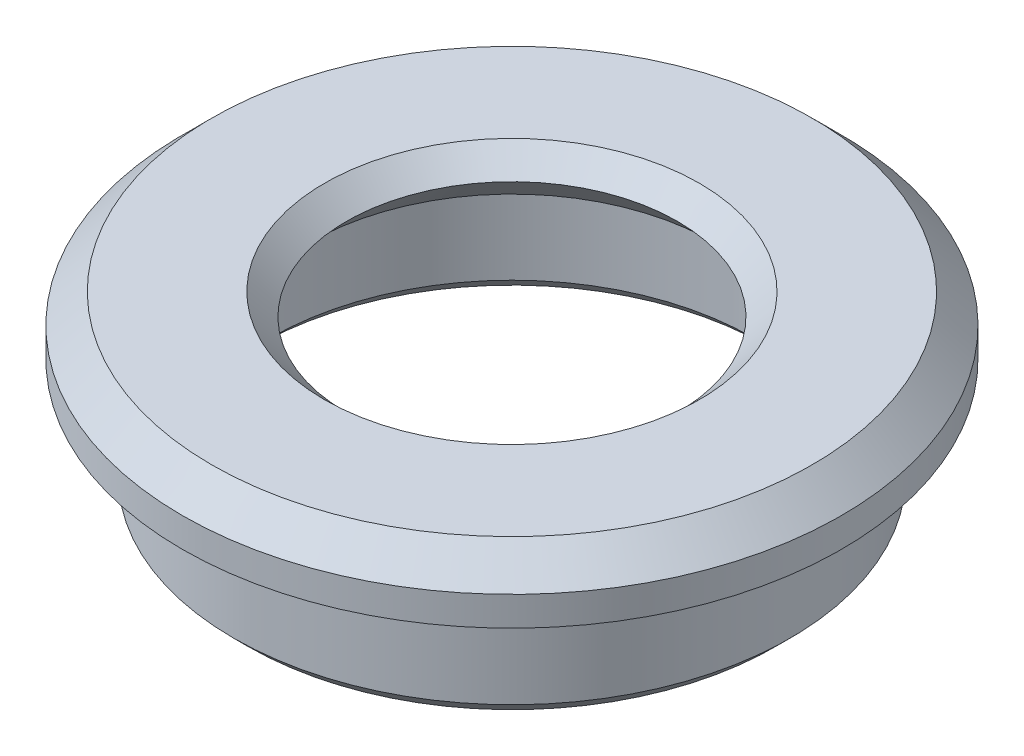
ISO-10303-21;
HEADER;
FILE_DESCRIPTION(('STEP AP214'),'2;1');
FILE_NAME('part.step','',(''),(''),'','','');
FILE_SCHEMA(('AUTOMOTIVE_DESIGN { 1 0 10303 214 1 1 1 1 }'));
ENDSEC;
DATA;
#1=APPLICATION_CONTEXT('core data for automotive mechanical design processes');
#2=APPLICATION_PROTOCOL_DEFINITION('international standard','automotive_design',2000,#1);
#3=PRODUCT_CONTEXT('',#1,'mechanical');
#4=PRODUCT('Part','Part','',(#3));
#5=PRODUCT_RELATED_PRODUCT_CATEGORY('part','',(#4));
#6=PRODUCT_DEFINITION_FORMATION('','',#4);
#7=PRODUCT_DEFINITION_CONTEXT('part definition',#1,'design');
#8=PRODUCT_DEFINITION('design','',#6,#7);
#9=PRODUCT_DEFINITION_SHAPE('','',#8);
#10=(LENGTH_UNIT() NAMED_UNIT(*) SI_UNIT(.MILLI.,.METRE.));
#11=(NAMED_UNIT(*) PLANE_ANGLE_UNIT() SI_UNIT($,.RADIAN.));
#12=(NAMED_UNIT(*) SI_UNIT($,.STERADIAN.) SOLID_ANGLE_UNIT());
#13=UNCERTAINTY_MEASURE_WITH_UNIT(LENGTH_MEASURE(1.E-05),#10,'distance_accuracy_value','');
#14=(GEOMETRIC_REPRESENTATION_CONTEXT(3) GLOBAL_UNCERTAINTY_ASSIGNED_CONTEXT((#13)) GLOBAL_UNIT_ASSIGNED_CONTEXT((#10,
#11,#12)) REPRESENTATION_CONTEXT('',''));
#15=CARTESIAN_POINT('',(0.,0.,0.));
#16=DIRECTION('',(0.,0.,1.));
#17=DIRECTION('',(1.,0.,0.));
#18=AXIS2_PLACEMENT_3D('',#15,#16,#17);
#19=CARTESIAN_POINT('',(0.,0.,0.));
#20=DIRECTION('',(0.,1.,0.));
#21=DIRECTION('',(0.,0.,1.));
#22=AXIS2_PLACEMENT_3D('',#19,#20,#21);
#23=PLANE('',#22);
#24=CARTESIAN_POINT('',(0.,0.,0.));
#25=DIRECTION('',(0.,1.,0.));
#26=DIRECTION('',(0.,0.,1.));
#27=AXIS2_PLACEMENT_3D('',#24,#25,#26);
#28=CIRCLE('',#27,8.75);
#29=CARTESIAN_POINT('',(0.,0.,8.75));
#30=VERTEX_POINT('',#29);
#31=EDGE_CURVE('E72',#30,#30,#28,.T.);
#32=ORIENTED_EDGE('',*,*,#31,.T.);
#33=EDGE_LOOP('',(#32));
#34=FACE_BOUND('',#33,.T.);
#35=CARTESIAN_POINT('',(0.,0.,0.));
#36=DIRECTION('',(0.,1.,0.));
#37=DIRECTION('',(0.,0.,1.));
#38=AXIS2_PLACEMENT_3D('',#35,#36,#37);
#39=CIRCLE('',#38,9.);
#40=CARTESIAN_POINT('',(0.,0.,9.));
#41=VERTEX_POINT('',#40);
#42=EDGE_CURVE('E76',#41,#41,#39,.F.);
#43=ORIENTED_EDGE('',*,*,#42,.T.);
#44=EDGE_LOOP('',(#43));
#45=FACE_BOUND('',#44,.T.);
#46=ADVANCED_FACE('F39',(#34,#45),#23,.F.);
#47=CARTESIAN_POINT('',(0.,4.,0.));
#48=DIRECTION('',(0.,-1.,0.));
#49=DIRECTION('',(0.,0.,-1.));
#50=AXIS2_PLACEMENT_3D('',#47,#48,#49);
#51=CYLINDRICAL_SURFACE('',#50,9.5);
#52=CARTESIAN_POINT('',(0.,0.500000000000004,0.));
#53=DIRECTION('',(0.,1.,0.));
#54=DIRECTION('',(0.,0.,1.));
#55=AXIS2_PLACEMENT_3D('',#52,#53,#54);
#56=CIRCLE('',#55,9.5);
#57=CARTESIAN_POINT('',(0.,0.500000000000004,9.5));
#58=VERTEX_POINT('',#57);
#59=EDGE_CURVE('E64',#58,#58,#56,.T.);
#60=ORIENTED_EDGE('',*,*,#59,.T.);
#61=EDGE_LOOP('',(#60));
#62=FACE_BOUND('',#61,.T.);
#63=CARTESIAN_POINT('',(0.,4.,0.));
#64=DIRECTION('',(0.,1.,0.));
#65=DIRECTION('',(0.,0.,1.));
#66=AXIS2_PLACEMENT_3D('',#63,#64,#65);
#67=CIRCLE('',#66,9.5);
#68=CARTESIAN_POINT('',(0.,4.,9.5));
#69=VERTEX_POINT('',#68);
#70=EDGE_CURVE('E84',#69,#69,#67,.T.);
#71=ORIENTED_EDGE('',*,*,#70,.F.);
#72=EDGE_LOOP('',(#71));
#73=FACE_BOUND('',#72,.T.);
#74=ADVANCED_FACE('F119',(#62,#73),#51,.T.);
#75=CARTESIAN_POINT('',(0.,4.,0.));
#76=DIRECTION('',(0.,-1.,0.));
#77=DIRECTION('',(0.,0.,-1.));
#78=AXIS2_PLACEMENT_3D('',#75,#76,#77);
#79=CYLINDRICAL_SURFACE('',#78,8.25);
#80=CARTESIAN_POINT('',(0.,0.499999999999999,0.));
#81=DIRECTION('',(0.,1.,0.));
#82=DIRECTION('',(0.,0.,1.));
#83=AXIS2_PLACEMENT_3D('',#80,#81,#82);
#84=CIRCLE('',#83,8.25);
#85=CARTESIAN_POINT('',(0.,0.499999999999999,8.25));
#86=VERTEX_POINT('',#85);
#87=EDGE_CURVE('E68',#86,#86,#84,.F.);
#88=ORIENTED_EDGE('',*,*,#87,.T.);
#89=EDGE_LOOP('',(#88));
#90=FACE_BOUND('',#89,.T.);
#91=CARTESIAN_POINT('',(0.,4.,0.));
#92=DIRECTION('',(0.,1.,0.));
#93=DIRECTION('',(0.,0.,1.));
#94=AXIS2_PLACEMENT_3D('',#91,#92,#93);
#95=CIRCLE('',#94,8.25);
#96=CARTESIAN_POINT('',(0.,4.,8.25));
#97=VERTEX_POINT('',#96);
#98=EDGE_CURVE('E88',#97,#97,#95,.T.);
#99=ORIENTED_EDGE('',*,*,#98,.T.);
#100=EDGE_LOOP('',(#99));
#101=FACE_BOUND('',#100,.T.);
#102=ADVANCED_FACE('F116',(#90,#101),#79,.F.);
#103=CARTESIAN_POINT('',(0.,4.,0.));
#104=DIRECTION('',(0.,1.,0.));
#105=DIRECTION('',(0.,0.,1.));
#106=AXIS2_PLACEMENT_3D('',#103,#104,#105);
#107=PLANE('',#106);
#108=CARTESIAN_POINT('',(0.,4.,0.));
#109=DIRECTION('',(0.,1.,0.));
#110=DIRECTION('',(0.,0.,1.));
#111=AXIS2_PLACEMENT_3D('',#108,#109,#110);
#112=CIRCLE('',#111,6.9);
#113=CARTESIAN_POINT('',(0.,4.,6.9));
#114=VERTEX_POINT('',#113);
#115=EDGE_CURVE('E80',#114,#114,#112,.T.);
#116=ORIENTED_EDGE('',*,*,#115,.T.);
#117=EDGE_LOOP('',(#116));
#118=FACE_BOUND('',#117,.T.);
#119=ORIENTED_EDGE('',*,*,#98,.F.);
#120=EDGE_LOOP('',(#119));
#121=FACE_BOUND('',#120,.T.);
#122=ADVANCED_FACE('F105',(#118,#121),#107,.F.);
#123=CARTESIAN_POINT('',(0.,6.,0.));
#124=DIRECTION('',(0.,-1.,0.));
#125=DIRECTION('',(0.,0.,-1.));
#126=AXIS2_PLACEMENT_3D('',#123,#124,#125);
#127=CYLINDRICAL_SURFACE('',#126,11.25);
#128=CARTESIAN_POINT('',(0.,5.,0.));
#129=DIRECTION('',(0.,1.,0.));
#130=DIRECTION('',(0.,0.,1.));
#131=AXIS2_PLACEMENT_3D('',#128,#129,#130);
#132=CIRCLE('',#131,11.25);
#133=CARTESIAN_POINT('',(0.,5.,11.25));
#134=VERTEX_POINT('',#133);
#135=EDGE_CURVE('E48',#134,#134,#132,.F.);
#136=ORIENTED_EDGE('',*,*,#135,.T.);
#137=EDGE_LOOP('',(#136));
#138=FACE_BOUND('',#137,.T.);
#139=CARTESIAN_POINT('',(0.,4.,0.));
#140=DIRECTION('',(0.,1.,0.));
#141=DIRECTION('',(0.,0.,1.));
#142=AXIS2_PLACEMENT_3D('',#139,#140,#141);
#143=CIRCLE('',#142,11.25);
#144=CARTESIAN_POINT('',(0.,4.,11.25));
#145=VERTEX_POINT('',#144);
#146=EDGE_CURVE('E92',#145,#145,#143,.T.);
#147=ORIENTED_EDGE('',*,*,#146,.T.);
#148=EDGE_LOOP('',(#147));
#149=FACE_BOUND('',#148,.T.);
#150=ADVANCED_FACE('F97',(#138,#149),#127,.T.);
#151=CARTESIAN_POINT('',(0.,6.,0.));
#152=DIRECTION('',(0.,1.,0.));
#153=DIRECTION('',(0.,0.,1.));
#154=AXIS2_PLACEMENT_3D('',#151,#152,#153);
#155=PLANE('',#154);
#156=CARTESIAN_POINT('',(0.,6.,0.));
#157=DIRECTION('',(0.,1.,0.));
#158=DIRECTION('',(0.,0.,1.));
#159=AXIS2_PLACEMENT_3D('',#156,#157,#158);
#160=CIRCLE('',#159,10.25);
#161=CARTESIAN_POINT('',(0.,6.,10.25));
#162=VERTEX_POINT('',#161);
#163=EDGE_CURVE('E53',#162,#162,#160,.T.);
#164=ORIENTED_EDGE('',*,*,#163,.T.);
#165=EDGE_LOOP('',(#164));
#166=FACE_BOUND('',#165,.T.);
#167=CARTESIAN_POINT('',(0.,6.,0.));
#168=DIRECTION('',(0.,1.,0.));
#169=DIRECTION('',(0.,0.,1.));
#170=AXIS2_PLACEMENT_3D('',#167,#168,#169);
#171=CIRCLE('',#170,6.40000000000001);
#172=CARTESIAN_POINT('',(0.,6.,6.40000000000001));
#173=VERTEX_POINT('',#172);
#174=EDGE_CURVE('E58',#173,#173,#171,.F.);
#175=ORIENTED_EDGE('',*,*,#174,.T.);
#176=EDGE_LOOP('',(#175));
#177=FACE_BOUND('',#176,.T.);
#178=ADVANCED_FACE('F102',(#166,#177),#155,.T.);
#179=ORIENTED_EDGE('',*,*,#70,.T.);
#180=EDGE_LOOP('',(#179));
#181=FACE_BOUND('',#180,.T.);
#182=ORIENTED_EDGE('',*,*,#146,.F.);
#183=EDGE_LOOP('',(#182));
#184=FACE_BOUND('',#183,.T.);
#185=ADVANCED_FACE('F99',(#181,#184),#107,.F.);
#186=CARTESIAN_POINT('',(0.,4.,0.));
#187=DIRECTION('',(0.,-1.,0.));
#188=DIRECTION('',(0.,0.,-1.));
#189=AXIS2_PLACEMENT_3D('',#186,#187,#188);
#190=CONICAL_SURFACE('',#189,6.9,0.785398163397447);
#191=CARTESIAN_POINT('',(0.,5.25,0.));
#192=DIRECTION('',(0.,1.,0.));
#193=DIRECTION('',(0.,0.,1.));
#194=AXIS2_PLACEMENT_3D('',#191,#192,#193);
#195=CIRCLE('',#194,5.65000000000001);
#196=CARTESIAN_POINT('',(0.,5.25,5.65000000000001));
#197=VERTEX_POINT('',#196);
#198=EDGE_CURVE('E10',#197,#197,#195,.T.);
#199=ORIENTED_EDGE('',*,*,#198,.T.);
#200=EDGE_LOOP('',(#199));
#201=FACE_BOUND('',#200,.T.);
#202=ORIENTED_EDGE('',*,*,#115,.F.);
#203=EDGE_LOOP('',(#202));
#204=FACE_BOUND('',#203,.T.);
#205=ADVANCED_FACE('F101',(#201,#204),#190,.F.);
#206=CARTESIAN_POINT('',(0.,0.,0.));
#207=DIRECTION('',(0.,-1.,0.));
#208=DIRECTION('',(0.,0.,-1.));
#209=AXIS2_PLACEMENT_3D('',#206,#207,#208);
#210=CONICAL_SURFACE('',#209,8.75,0.785398163397445);
#211=ORIENTED_EDGE('',*,*,#87,.F.);
#212=EDGE_LOOP('',(#211));
#213=FACE_BOUND('',#212,.T.);
#214=ORIENTED_EDGE('',*,*,#31,.F.);
#215=EDGE_LOOP('',(#214));
#216=FACE_BOUND('',#215,.T.);
#217=ADVANCED_FACE('F110',(#213,#216),#210,.F.);
#218=CARTESIAN_POINT('',(0.,0.500000000000004,0.));
#219=DIRECTION('',(0.,1.,0.));
#220=DIRECTION('',(0.,0.,1.));
#221=AXIS2_PLACEMENT_3D('',#218,#219,#220);
#222=CONICAL_SURFACE('',#221,9.5,0.785398163397448);
#223=ORIENTED_EDGE('',*,*,#42,.F.);
#224=EDGE_LOOP('',(#223));
#225=FACE_BOUND('',#224,.T.);
#226=ORIENTED_EDGE('',*,*,#59,.F.);
#227=EDGE_LOOP('',(#226));
#228=FACE_BOUND('',#227,.T.);
#229=ADVANCED_FACE('F139',(#225,#228),#222,.T.);
#230=CARTESIAN_POINT('',(0.,6.,0.));
#231=DIRECTION('',(0.,-1.,0.));
#232=DIRECTION('',(0.,0.,-1.));
#233=AXIS2_PLACEMENT_3D('',#230,#231,#232);
#234=CONICAL_SURFACE('',#233,10.25,0.785398163397447);
#235=ORIENTED_EDGE('',*,*,#135,.F.);
#236=EDGE_LOOP('',(#235));
#237=FACE_BOUND('',#236,.T.);
#238=ORIENTED_EDGE('',*,*,#163,.F.);
#239=EDGE_LOOP('',(#238));
#240=FACE_BOUND('',#239,.T.);
#241=ADVANCED_FACE('F145',(#237,#240),#234,.T.);
#242=CARTESIAN_POINT('',(0.,4.99999999999998,0.));
#243=DIRECTION('',(0.,1.,0.));
#244=DIRECTION('',(0.,0.,1.));
#245=AXIS2_PLACEMENT_3D('',#242,#243,#244);
#246=CONICAL_SURFACE('',#245,5.4,0.785398163397443);
#247=ORIENTED_EDGE('',*,*,#174,.F.);
#248=EDGE_LOOP('',(#247));
#249=FACE_BOUND('',#248,.T.);
#250=ORIENTED_EDGE('',*,*,#198,.F.);
#251=EDGE_LOOP('',(#250));
#252=FACE_BOUND('',#251,.T.);
#253=ADVANCED_FACE('F42',(#249,#252),#246,.F.);
#254=CLOSED_SHELL('',(#46,#74,#102,#122,#150,#178,#185,#205,#217,#229,#241,#253));
#255=MANIFOLD_SOLID_BREP('B2',#254);
#256=ADVANCED_BREP_SHAPE_REPRESENTATION('',(#18,#255),#14);
#257=SHAPE_DEFINITION_REPRESENTATION(#9,#256);
ENDSEC;
END-ISO-10303-21;
